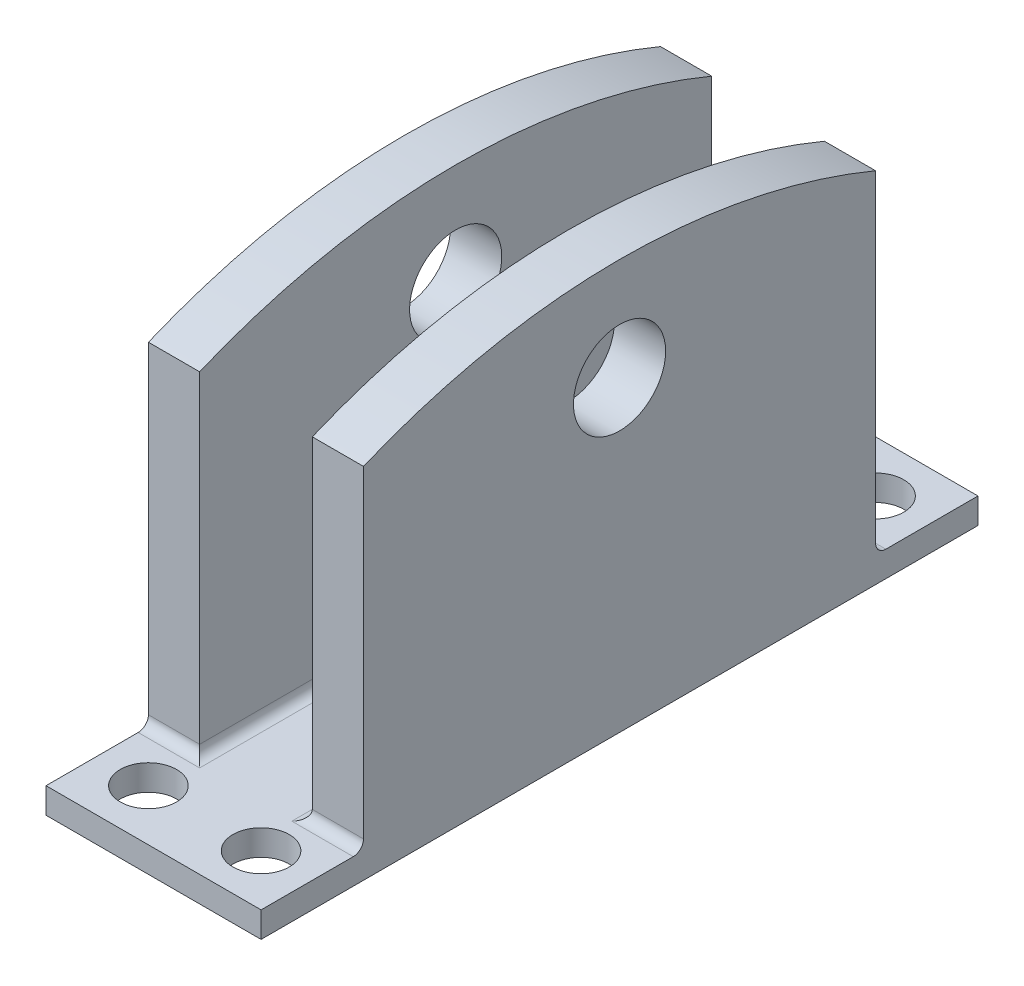
ISO-10303-21;
HEADER;
FILE_DESCRIPTION(('STEP AP214'),'2;1');
FILE_NAME('part.step','',(''),(''),'','','');
FILE_SCHEMA(('AUTOMOTIVE_DESIGN { 1 0 10303 214 1 1 1 1 }'));
ENDSEC;
DATA;
#1=APPLICATION_CONTEXT('core data for automotive mechanical design processes');
#2=APPLICATION_PROTOCOL_DEFINITION('international standard','automotive_design',2000,#1);
#3=PRODUCT_CONTEXT('',#1,'mechanical');
#4=PRODUCT('Part','Part','',(#3));
#5=PRODUCT_RELATED_PRODUCT_CATEGORY('part','',(#4));
#6=PRODUCT_DEFINITION_FORMATION('','',#4);
#7=PRODUCT_DEFINITION_CONTEXT('part definition',#1,'design');
#8=PRODUCT_DEFINITION('design','',#6,#7);
#9=PRODUCT_DEFINITION_SHAPE('','',#8);
#10=(LENGTH_UNIT() NAMED_UNIT(*) SI_UNIT(.MILLI.,.METRE.));
#11=(NAMED_UNIT(*) PLANE_ANGLE_UNIT() SI_UNIT($,.RADIAN.));
#12=(NAMED_UNIT(*) SI_UNIT($,.STERADIAN.) SOLID_ANGLE_UNIT());
#13=UNCERTAINTY_MEASURE_WITH_UNIT(LENGTH_MEASURE(1.E-05),#10,'distance_accuracy_value','');
#14=(GEOMETRIC_REPRESENTATION_CONTEXT(3) GLOBAL_UNCERTAINTY_ASSIGNED_CONTEXT((#13)) GLOBAL_UNIT_ASSIGNED_CONTEXT((#10,
#11,#12)) REPRESENTATION_CONTEXT('',''));
#15=CARTESIAN_POINT('',(0.,0.,0.));
#16=DIRECTION('',(0.,0.,1.));
#17=DIRECTION('',(1.,0.,0.));
#18=AXIS2_PLACEMENT_3D('',#15,#16,#17);
#19=CARTESIAN_POINT('',(5.25352057567163,2.5,50.));
#20=DIRECTION('',(0.,-1.,0.));
#21=DIRECTION('',(1.,0.,0.));
#22=AXIS2_PLACEMENT_3D('',#19,#20,#21);
#23=PLANE('',#22);
#24=CARTESIAN_POINT('',(5.25352057567163,2.5,55.));
#25=DIRECTION('',(0.,1.,0.));
#26=DIRECTION('',(0.,0.,1.));
#27=AXIS2_PLACEMENT_3D('',#24,#25,#26);
#28=CIRCLE('',#27,2.75);
#29=CARTESIAN_POINT('',(5.25352057567163,2.5,57.75));
#30=VERTEX_POINT('',#29);
#31=EDGE_CURVE('E316',#30,#30,#28,.T.);
#32=ORIENTED_EDGE('',*,*,#31,.F.);
#33=EDGE_LOOP('',(#32));
#34=FACE_BOUND('',#33,.T.);
#35=CARTESIAN_POINT('',(16.2535205756716,2.5,55.));
#36=DIRECTION('',(0.,1.,0.));
#37=DIRECTION('',(0.,0.,1.));
#38=AXIS2_PLACEMENT_3D('',#35,#36,#37);
#39=CIRCLE('',#38,2.75);
#40=CARTESIAN_POINT('',(16.2535205756716,2.5,57.75));
#41=VERTEX_POINT('',#40);
#42=EDGE_CURVE('E310',#41,#41,#39,.T.);
#43=ORIENTED_EDGE('',*,*,#42,.F.);
#44=EDGE_LOOP('',(#43));
#45=FACE_BOUND('',#44,.T.);
#46=CARTESIAN_POINT('',(5.25352057567163,2.5,-5.));
#47=DIRECTION('',(0.,1.,0.));
#48=DIRECTION('',(0.,0.,1.));
#49=AXIS2_PLACEMENT_3D('',#46,#47,#48);
#50=CIRCLE('',#49,2.75);
#51=CARTESIAN_POINT('',(5.25352057567163,2.5,-2.25));
#52=VERTEX_POINT('',#51);
#53=EDGE_CURVE('E304',#52,#52,#50,.T.);
#54=ORIENTED_EDGE('',*,*,#53,.F.);
#55=EDGE_LOOP('',(#54));
#56=FACE_BOUND('',#55,.T.);
#57=DIRECTION('',(0.,0.,-1.));
#58=VECTOR('',#57,1.);
#59=CARTESIAN_POINT('',(6.25352057567163,2.5,50.));
#60=LINE('',#59,#58);
#61=CARTESIAN_POINT('',(6.25352057567163,2.5,-1.));
#62=VERTEX_POINT('',#61);
#63=CARTESIAN_POINT('',(6.25352057567163,2.5,51.));
#64=VERTEX_POINT('',#63);
#65=EDGE_CURVE('E264',#62,#64,#60,.F.);
#66=ORIENTED_EDGE('',*,*,#65,.T.);
#67=DIRECTION('',(1.,0.,0.));
#68=VECTOR('',#67,1.);
#69=CARTESIAN_POINT('',(5.25352057567163,2.5,51.));
#70=LINE('',#69,#68);
#71=CARTESIAN_POINT('',(0.253520575671634,2.5,51.));
#72=VERTEX_POINT('',#71);
#73=EDGE_CURVE('E266',#64,#72,#70,.F.);
#74=ORIENTED_EDGE('',*,*,#73,.T.);
#75=DIRECTION('',(0.,0.,-1.));
#76=VECTOR('',#75,1.);
#77=CARTESIAN_POINT('',(0.253520575671635,2.5,50.));
#78=LINE('',#77,#76);
#79=CARTESIAN_POINT('',(0.253520575671627,2.5,60.));
#80=VERTEX_POINT('',#79);
#81=EDGE_CURVE('E170',#80,#72,#78,.T.);
#82=ORIENTED_EDGE('',*,*,#81,.F.);
#83=DIRECTION('',(-1.,0.,0.));
#84=VECTOR('',#83,1.);
#85=CARTESIAN_POINT('',(21.2535205756716,2.5,60.));
#86=LINE('',#85,#84);
#87=CARTESIAN_POINT('',(21.2535205756716,2.5,60.));
#88=VERTEX_POINT('',#87);
#89=EDGE_CURVE('E161',#88,#80,#86,.T.);
#90=ORIENTED_EDGE('',*,*,#89,.F.);
#91=DIRECTION('',(0.,0.,1.));
#92=VECTOR('',#91,1.);
#93=CARTESIAN_POINT('',(21.2535205756716,2.5,50.));
#94=LINE('',#93,#92);
#95=CARTESIAN_POINT('',(21.2535205756716,2.5,51.));
#96=VERTEX_POINT('',#95);
#97=EDGE_CURVE('E150',#96,#88,#94,.T.);
#98=ORIENTED_EDGE('',*,*,#97,.F.);
#99=DIRECTION('',(1.,0.,0.));
#100=VECTOR('',#99,1.);
#101=CARTESIAN_POINT('',(5.25352057567163,2.5,51.));
#102=LINE('',#101,#100);
#103=CARTESIAN_POINT('',(15.2535205756716,2.5,51.));
#104=VERTEX_POINT('',#103);
#105=EDGE_CURVE('E260',#96,#104,#102,.F.);
#106=ORIENTED_EDGE('',*,*,#105,.T.);
#107=DIRECTION('',(0.,0.,-1.));
#108=VECTOR('',#107,1.);
#109=CARTESIAN_POINT('',(15.2535205756716,2.5,0.));
#110=LINE('',#109,#108);
#111=CARTESIAN_POINT('',(15.2535205756716,2.5,-1.));
#112=VERTEX_POINT('',#111);
#113=EDGE_CURVE('E257',#104,#112,#110,.T.);
#114=ORIENTED_EDGE('',*,*,#113,.T.);
#115=DIRECTION('',(-1.,0.,0.));
#116=VECTOR('',#115,1.);
#117=CARTESIAN_POINT('',(21.2535205756716,2.5,-1.));
#118=LINE('',#117,#116);
#119=CARTESIAN_POINT('',(21.2535205756716,2.5,-1.));
#120=VERTEX_POINT('',#119);
#121=EDGE_CURVE('E253',#112,#120,#118,.F.);
#122=ORIENTED_EDGE('',*,*,#121,.T.);
#123=DIRECTION('',(0.,0.,1.));
#124=VECTOR('',#123,1.);
#125=CARTESIAN_POINT('',(21.2535205756716,2.5,0.));
#126=LINE('',#125,#124);
#127=CARTESIAN_POINT('',(21.2535205756716,2.5,-10.));
#128=VERTEX_POINT('',#127);
#129=EDGE_CURVE('E183',#128,#120,#126,.T.);
#130=ORIENTED_EDGE('',*,*,#129,.F.);
#131=DIRECTION('',(1.,0.,0.));
#132=VECTOR('',#131,1.);
#133=CARTESIAN_POINT('',(21.2535205756716,2.5,-10.));
#134=LINE('',#133,#132);
#135=CARTESIAN_POINT('',(0.253520575671635,2.5,-10.));
#136=VERTEX_POINT('',#135);
#137=EDGE_CURVE('E187',#136,#128,#134,.T.);
#138=ORIENTED_EDGE('',*,*,#137,.F.);
#139=DIRECTION('',(0.,0.,-1.));
#140=VECTOR('',#139,1.);
#141=CARTESIAN_POINT('',(0.253520575671635,2.5,0.));
#142=LINE('',#141,#140);
#143=CARTESIAN_POINT('',(0.253520575671635,2.5,-1.));
#144=VERTEX_POINT('',#143);
#145=EDGE_CURVE('E185',#144,#136,#142,.T.);
#146=ORIENTED_EDGE('',*,*,#145,.F.);
#147=DIRECTION('',(-1.,0.,0.));
#148=VECTOR('',#147,1.);
#149=CARTESIAN_POINT('',(5.25352057567163,2.5,-1.));
#150=LINE('',#149,#148);
#151=EDGE_CURVE('E262',#144,#62,#150,.F.);
#152=ORIENTED_EDGE('',*,*,#151,.T.);
#153=EDGE_LOOP('',(#66,#74,#82,#90,#98,#106,#114,#122,#130,#138,#146,#152));
#154=FACE_BOUND('',#153,.T.);
#155=CARTESIAN_POINT('',(16.2535205756716,2.5,-5.));
#156=DIRECTION('',(0.,1.,0.));
#157=DIRECTION('',(0.,0.,1.));
#158=AXIS2_PLACEMENT_3D('',#155,#156,#157);
#159=CIRCLE('',#158,2.75);
#160=CARTESIAN_POINT('',(16.2535205756716,2.5,-2.25));
#161=VERTEX_POINT('',#160);
#162=EDGE_CURVE('E295',#161,#161,#159,.T.);
#163=ORIENTED_EDGE('',*,*,#162,.F.);
#164=EDGE_LOOP('',(#163));
#165=FACE_BOUND('',#164,.T.);
#166=ADVANCED_FACE('F35',(#34,#45,#56,#154,#165),#23,.F.);
#167=CARTESIAN_POINT('',(0.,0.,50.));
#168=DIRECTION('',(0.,0.,1.));
#169=DIRECTION('',(1.,0.,0.));
#170=AXIS2_PLACEMENT_3D('',#167,#168,#169);
#171=PLANE('',#170);
#172=DIRECTION('',(0.,-1.,0.));
#173=VECTOR('',#172,1.);
#174=CARTESIAN_POINT('',(0.253520575671628,50.,50.));
#175=LINE('',#174,#173);
#176=CARTESIAN_POINT('',(0.253520575671622,35.,50.));
#177=VERTEX_POINT('',#176);
#178=CARTESIAN_POINT('',(0.253520575671633,3.5,50.));
#179=VERTEX_POINT('',#178);
#180=EDGE_CURVE('E228',#177,#179,#175,.T.);
#181=ORIENTED_EDGE('',*,*,#180,.T.);
#182=DIRECTION('',(1.,0.,0.));
#183=VECTOR('',#182,1.);
#184=CARTESIAN_POINT('',(0.,3.5,50.));
#185=LINE('',#184,#183);
#186=CARTESIAN_POINT('',(5.25352057567163,3.5,50.));
#187=VERTEX_POINT('',#186);
#188=EDGE_CURVE('E275',#179,#187,#185,.T.);
#189=ORIENTED_EDGE('',*,*,#188,.T.);
#190=DIRECTION('',(0.,1.,0.));
#191=VECTOR('',#190,1.);
#192=CARTESIAN_POINT('',(5.25352057567163,50.,50.));
#193=LINE('',#192,#191);
#194=CARTESIAN_POINT('',(5.25352057567163,35.,50.));
#195=VERTEX_POINT('',#194);
#196=EDGE_CURVE('E237',#187,#195,#193,.T.);
#197=ORIENTED_EDGE('',*,*,#196,.T.);
#198=DIRECTION('',(1.,0.,0.));
#199=VECTOR('',#198,1.);
#200=CARTESIAN_POINT('',(0.253520575671622,35.,50.));
#201=LINE('',#200,#199);
#202=EDGE_CURVE('E215',#177,#195,#201,.T.);
#203=ORIENTED_EDGE('',*,*,#202,.F.);
#204=EDGE_LOOP('',(#181,#189,#197,#203));
#205=FACE_BOUND('',#204,.T.);
#206=ADVANCED_FACE('F324',(#205),#171,.T.);
#207=DIRECTION('',(0.,-1.,0.));
#208=VECTOR('',#207,1.);
#209=CARTESIAN_POINT('',(16.2535205756716,50.,50.));
#210=LINE('',#209,#208);
#211=CARTESIAN_POINT('',(16.2535205756716,35.,50.));
#212=VERTEX_POINT('',#211);
#213=CARTESIAN_POINT('',(16.2535205756716,3.5,50.));
#214=VERTEX_POINT('',#213);
#215=EDGE_CURVE('E234',#212,#214,#210,.T.);
#216=ORIENTED_EDGE('',*,*,#215,.T.);
#217=DIRECTION('',(1.,0.,0.));
#218=VECTOR('',#217,1.);
#219=CARTESIAN_POINT('',(0.,3.5,50.));
#220=LINE('',#219,#218);
#221=CARTESIAN_POINT('',(21.2535205756716,3.5,50.));
#222=VERTEX_POINT('',#221);
#223=EDGE_CURVE('E273',#214,#222,#220,.T.);
#224=ORIENTED_EDGE('',*,*,#223,.T.);
#225=DIRECTION('',(0.,1.,0.));
#226=VECTOR('',#225,1.);
#227=CARTESIAN_POINT('',(21.2535205756716,50.,50.));
#228=LINE('',#227,#226);
#229=CARTESIAN_POINT('',(21.2535205756716,35.,50.));
#230=VERTEX_POINT('',#229);
#231=EDGE_CURVE('E231',#222,#230,#228,.T.);
#232=ORIENTED_EDGE('',*,*,#231,.T.);
#233=EDGE_CURVE('E219',#212,#230,#201,.T.);
#234=ORIENTED_EDGE('',*,*,#233,.F.);
#235=EDGE_LOOP('',(#216,#224,#232,#234));
#236=FACE_BOUND('',#235,.T.);
#237=ADVANCED_FACE('F368',(#236),#171,.T.);
#238=CARTESIAN_POINT('',(0.,0.,0.));
#239=DIRECTION('',(0.,0.,1.));
#240=DIRECTION('',(1.,0.,0.));
#241=AXIS2_PLACEMENT_3D('',#238,#239,#240);
#242=PLANE('',#241);
#243=DIRECTION('',(0.,1.,0.));
#244=VECTOR('',#243,1.);
#245=CARTESIAN_POINT('',(21.2535205756716,50.,0.));
#246=LINE('',#245,#244);
#247=CARTESIAN_POINT('',(21.2535205756716,3.5,0.));
#248=VERTEX_POINT('',#247);
#249=CARTESIAN_POINT('',(21.2535205756716,35.,0.));
#250=VERTEX_POINT('',#249);
#251=EDGE_CURVE('E241',#248,#250,#246,.T.);
#252=ORIENTED_EDGE('',*,*,#251,.F.);
#253=DIRECTION('',(-1.,0.,0.));
#254=VECTOR('',#253,1.);
#255=CARTESIAN_POINT('',(16.2535205756716,3.5,0.));
#256=LINE('',#255,#254);
#257=CARTESIAN_POINT('',(16.2535205756716,3.5,0.));
#258=VERTEX_POINT('',#257);
#259=EDGE_CURVE('E278',#248,#258,#256,.T.);
#260=ORIENTED_EDGE('',*,*,#259,.T.);
#261=DIRECTION('',(0.,-1.,0.));
#262=VECTOR('',#261,1.);
#263=CARTESIAN_POINT('',(16.2535205756716,50.,0.));
#264=LINE('',#263,#262);
#265=CARTESIAN_POINT('',(16.2535205756716,35.,0.));
#266=VERTEX_POINT('',#265);
#267=EDGE_CURVE('E243',#266,#258,#264,.T.);
#268=ORIENTED_EDGE('',*,*,#267,.F.);
#269=DIRECTION('',(1.,0.,0.));
#270=VECTOR('',#269,1.);
#271=CARTESIAN_POINT('',(0.253520575671622,35.,0.));
#272=LINE('',#271,#270);
#273=EDGE_CURVE('E250',#266,#250,#272,.T.);
#274=ORIENTED_EDGE('',*,*,#273,.T.);
#275=EDGE_LOOP('',(#252,#260,#268,#274));
#276=FACE_BOUND('',#275,.T.);
#277=ADVANCED_FACE('F373',(#276),#242,.F.);
#278=CARTESIAN_POINT('',(0.253520575671628,50.,50.));
#279=DIRECTION('',(1.,0.,0.));
#280=DIRECTION('',(0.,1.,0.));
#281=AXIS2_PLACEMENT_3D('',#278,#279,#280);
#282=PLANE('',#281);
#283=CARTESIAN_POINT('',(0.253520575671632,30.,25.));
#284=DIRECTION('',(1.,0.,0.));
#285=DIRECTION('',(0.,1.,0.));
#286=AXIS2_PLACEMENT_3D('',#283,#284,#285);
#287=CIRCLE('',#286,4.5);
#288=CARTESIAN_POINT('',(0.253520575671631,34.5,25.));
#289=VERTEX_POINT('',#288);
#290=EDGE_CURVE('E205',#289,#289,#287,.T.);
#291=ORIENTED_EDGE('',*,*,#290,.T.);
#292=EDGE_LOOP('',(#291));
#293=FACE_BOUND('',#292,.T.);
#294=ORIENTED_EDGE('',*,*,#180,.F.);
#295=CARTESIAN_POINT('',(0.253520575671635,-25.0000000000001,25.));
#296=DIRECTION('',(-1.,0.,0.));
#297=DIRECTION('',(0.,-1.,0.));
#298=AXIS2_PLACEMENT_3D('',#295,#296,#297);
#299=CIRCLE('',#298,65.);
#300=CARTESIAN_POINT('',(0.253520575671622,35.,0.));
#301=VERTEX_POINT('',#300);
#302=EDGE_CURVE('E209',#177,#301,#299,.T.);
#303=ORIENTED_EDGE('',*,*,#302,.T.);
#304=DIRECTION('',(0.,-1.,0.));
#305=VECTOR('',#304,1.);
#306=CARTESIAN_POINT('',(0.253520575671628,50.,0.));
#307=LINE('',#306,#305);
#308=CARTESIAN_POINT('',(0.253520575671633,3.5,0.));
#309=VERTEX_POINT('',#308);
#310=EDGE_CURVE('E227',#301,#309,#307,.T.);
#311=ORIENTED_EDGE('',*,*,#310,.T.);
#312=CARTESIAN_POINT('',(0.253520575671633,3.5,-1.));
#313=DIRECTION('',(1.,0.,0.));
#314=DIRECTION('',(0.,1.,0.));
#315=AXIS2_PLACEMENT_3D('',#312,#313,#314);
#316=CIRCLE('',#315,1.);
#317=EDGE_CURVE('E44',#309,#144,#316,.T.);
#318=ORIENTED_EDGE('',*,*,#317,.T.);
#319=ORIENTED_EDGE('',*,*,#145,.T.);
#320=DIRECTION('',(0.,-1.,0.));
#321=VECTOR('',#320,1.);
#322=CARTESIAN_POINT('',(0.253520575671635,2.5,-10.));
#323=LINE('',#322,#321);
#324=CARTESIAN_POINT('',(0.253520575671635,0.,-10.));
#325=VERTEX_POINT('',#324);
#326=EDGE_CURVE('E190',#136,#325,#323,.T.);
#327=ORIENTED_EDGE('',*,*,#326,.T.);
#328=DIRECTION('',(0.,0.,-1.));
#329=VECTOR('',#328,1.);
#330=CARTESIAN_POINT('',(0.253520575671634,0.,50.));
#331=LINE('',#330,#329);
#332=CARTESIAN_POINT('',(0.253520575671627,0.,60.));
#333=VERTEX_POINT('',#332);
#334=EDGE_CURVE('E248',#333,#325,#331,.T.);
#335=ORIENTED_EDGE('',*,*,#334,.F.);
#336=DIRECTION('',(0.,-1.,0.));
#337=VECTOR('',#336,1.);
#338=CARTESIAN_POINT('',(0.253520575671627,2.5,60.));
#339=LINE('',#338,#337);
#340=EDGE_CURVE('E169',#80,#333,#339,.T.);
#341=ORIENTED_EDGE('',*,*,#340,.F.);
#342=ORIENTED_EDGE('',*,*,#81,.T.);
#343=CARTESIAN_POINT('',(0.253520575671633,3.5,51.));
#344=DIRECTION('',(1.,0.,0.));
#345=DIRECTION('',(0.,1.,0.));
#346=AXIS2_PLACEMENT_3D('',#343,#344,#345);
#347=CIRCLE('',#346,1.);
#348=EDGE_CURVE('E281',#72,#179,#347,.T.);
#349=ORIENTED_EDGE('',*,*,#348,.T.);
#350=EDGE_LOOP('',(#294,#303,#311,#318,#319,#327,#335,#341,#342,#349));
#351=FACE_BOUND('',#350,.T.);
#352=ADVANCED_FACE('F387',(#293,#351),#282,.F.);
#353=CARTESIAN_POINT('',(0.253520575671634,0.,50.));
#354=DIRECTION('',(0.,1.,0.));
#355=DIRECTION('',(-1.,0.,0.));
#356=AXIS2_PLACEMENT_3D('',#353,#354,#355);
#357=PLANE('',#356);
#358=CARTESIAN_POINT('',(5.25352057567163,0.,55.));
#359=DIRECTION('',(0.,1.,0.));
#360=DIRECTION('',(0.,0.,1.));
#361=AXIS2_PLACEMENT_3D('',#358,#359,#360);
#362=CIRCLE('',#361,2.75);
#363=CARTESIAN_POINT('',(5.25352057567163,0.,57.75));
#364=VERTEX_POINT('',#363);
#365=EDGE_CURVE('E313',#364,#364,#362,.T.);
#366=ORIENTED_EDGE('',*,*,#365,.T.);
#367=EDGE_LOOP('',(#366));
#368=FACE_BOUND('',#367,.T.);
#369=CARTESIAN_POINT('',(16.2535205756716,0.,55.));
#370=DIRECTION('',(0.,1.,0.));
#371=DIRECTION('',(0.,0.,1.));
#372=AXIS2_PLACEMENT_3D('',#369,#370,#371);
#373=CIRCLE('',#372,2.75);
#374=CARTESIAN_POINT('',(16.2535205756716,0.,57.75));
#375=VERTEX_POINT('',#374);
#376=EDGE_CURVE('E307',#375,#375,#373,.T.);
#377=ORIENTED_EDGE('',*,*,#376,.T.);
#378=EDGE_LOOP('',(#377));
#379=FACE_BOUND('',#378,.T.);
#380=CARTESIAN_POINT('',(5.25352057567163,0.,-5.));
#381=DIRECTION('',(0.,1.,0.));
#382=DIRECTION('',(0.,0.,1.));
#383=AXIS2_PLACEMENT_3D('',#380,#381,#382);
#384=CIRCLE('',#383,2.75);
#385=CARTESIAN_POINT('',(5.25352057567163,0.,-2.25));
#386=VERTEX_POINT('',#385);
#387=EDGE_CURVE('E299',#386,#386,#384,.T.);
#388=ORIENTED_EDGE('',*,*,#387,.T.);
#389=EDGE_LOOP('',(#388));
#390=FACE_BOUND('',#389,.T.);
#391=CARTESIAN_POINT('',(16.2535205756716,0.,-5.));
#392=DIRECTION('',(0.,1.,0.));
#393=DIRECTION('',(0.,0.,1.));
#394=AXIS2_PLACEMENT_3D('',#391,#392,#393);
#395=CIRCLE('',#394,2.75);
#396=CARTESIAN_POINT('',(16.2535205756716,0.,-2.25));
#397=VERTEX_POINT('',#396);
#398=EDGE_CURVE('E288',#397,#397,#395,.T.);
#399=ORIENTED_EDGE('',*,*,#398,.T.);
#400=EDGE_LOOP('',(#399));
#401=FACE_BOUND('',#400,.T.);
#402=ORIENTED_EDGE('',*,*,#334,.T.);
#403=DIRECTION('',(1.,0.,0.));
#404=VECTOR('',#403,1.);
#405=CARTESIAN_POINT('',(21.2535205756716,0.,-10.));
#406=LINE('',#405,#404);
#407=CARTESIAN_POINT('',(21.2535205756716,0.,-10.));
#408=VERTEX_POINT('',#407);
#409=EDGE_CURVE('E181',#325,#408,#406,.T.);
#410=ORIENTED_EDGE('',*,*,#409,.T.);
#411=DIRECTION('',(0.,0.,-1.));
#412=VECTOR('',#411,1.);
#413=CARTESIAN_POINT('',(21.2535205756716,0.,50.));
#414=LINE('',#413,#412);
#415=CARTESIAN_POINT('',(21.2535205756716,0.,60.));
#416=VERTEX_POINT('',#415);
#417=EDGE_CURVE('E239',#416,#408,#414,.T.);
#418=ORIENTED_EDGE('',*,*,#417,.F.);
#419=DIRECTION('',(-1.,0.,0.));
#420=VECTOR('',#419,1.);
#421=CARTESIAN_POINT('',(21.2535205756716,0.,60.));
#422=LINE('',#421,#420);
#423=EDGE_CURVE('E162',#416,#333,#422,.T.);
#424=ORIENTED_EDGE('',*,*,#423,.T.);
#425=EDGE_LOOP('',(#402,#410,#418,#424));
#426=FACE_BOUND('',#425,.T.);
#427=ADVANCED_FACE('F383',(#368,#379,#390,#401,#426),#357,.F.);
#428=CARTESIAN_POINT('',(21.2535205756716,50.,50.));
#429=DIRECTION('',(-1.,0.,0.));
#430=DIRECTION('',(0.,0.,1.));
#431=AXIS2_PLACEMENT_3D('',#428,#429,#430);
#432=PLANE('',#431);
#433=CARTESIAN_POINT('',(21.2535205756716,30.,25.));
#434=DIRECTION('',(1.,0.,0.));
#435=DIRECTION('',(0.,0.,-1.));
#436=AXIS2_PLACEMENT_3D('',#433,#434,#435);
#437=CIRCLE('',#436,4.5);
#438=CARTESIAN_POINT('',(21.2535205756716,30.,20.5));
#439=VERTEX_POINT('',#438);
#440=EDGE_CURVE('E196',#439,#439,#437,.T.);
#441=ORIENTED_EDGE('',*,*,#440,.F.);
#442=EDGE_LOOP('',(#441));
#443=FACE_BOUND('',#442,.T.);
#444=ORIENTED_EDGE('',*,*,#417,.T.);
#445=DIRECTION('',(0.,-1.,0.));
#446=VECTOR('',#445,1.);
#447=CARTESIAN_POINT('',(21.2535205756716,2.5,-10.));
#448=LINE('',#447,#446);
#449=EDGE_CURVE('E193',#128,#408,#448,.T.);
#450=ORIENTED_EDGE('',*,*,#449,.F.);
#451=ORIENTED_EDGE('',*,*,#129,.T.);
#452=CARTESIAN_POINT('',(21.2535205756716,3.5,-1.));
#453=DIRECTION('',(-1.,0.,0.));
#454=DIRECTION('',(0.,0.,1.));
#455=AXIS2_PLACEMENT_3D('',#452,#453,#454);
#456=CIRCLE('',#455,1.);
#457=EDGE_CURVE('E11',#120,#248,#456,.T.);
#458=ORIENTED_EDGE('',*,*,#457,.T.);
#459=ORIENTED_EDGE('',*,*,#251,.T.);
#460=CARTESIAN_POINT('',(21.2535205756716,-25.,25.));
#461=DIRECTION('',(-1.,0.,0.));
#462=DIRECTION('',(0.,-1.,0.));
#463=AXIS2_PLACEMENT_3D('',#460,#461,#462);
#464=CIRCLE('',#463,65.);
#465=EDGE_CURVE('E208',#230,#250,#464,.T.);
#466=ORIENTED_EDGE('',*,*,#465,.F.);
#467=ORIENTED_EDGE('',*,*,#231,.F.);
#468=CARTESIAN_POINT('',(21.2535205756716,3.5,51.));
#469=DIRECTION('',(-1.,0.,0.));
#470=DIRECTION('',(0.,0.,1.));
#471=AXIS2_PLACEMENT_3D('',#468,#469,#470);
#472=CIRCLE('',#471,1.);
#473=EDGE_CURVE('E157',#222,#96,#472,.T.);
#474=ORIENTED_EDGE('',*,*,#473,.T.);
#475=ORIENTED_EDGE('',*,*,#97,.T.);
#476=DIRECTION('',(0.,-1.,0.));
#477=VECTOR('',#476,1.);
#478=CARTESIAN_POINT('',(21.2535205756716,2.5,60.));
#479=LINE('',#478,#477);
#480=EDGE_CURVE('E153',#88,#416,#479,.T.);
#481=ORIENTED_EDGE('',*,*,#480,.T.);
#482=EDGE_LOOP('',(#444,#450,#451,#458,#459,#466,#467,#474,#475,#481));
#483=FACE_BOUND('',#482,.T.);
#484=ADVANCED_FACE('F152',(#443,#483),#432,.F.);
#485=CARTESIAN_POINT('',(16.2535205756716,50.,50.));
#486=DIRECTION('',(1.,0.,0.));
#487=DIRECTION('',(0.,1.,0.));
#488=AXIS2_PLACEMENT_3D('',#485,#486,#487);
#489=PLANE('',#488);
#490=CARTESIAN_POINT('',(16.2535205756716,30.,25.));
#491=DIRECTION('',(1.,0.,0.));
#492=DIRECTION('',(0.,1.,0.));
#493=AXIS2_PLACEMENT_3D('',#490,#491,#492);
#494=CIRCLE('',#493,4.5);
#495=CARTESIAN_POINT('',(16.2535205756716,34.5,25.));
#496=VERTEX_POINT('',#495);
#497=EDGE_CURVE('E202',#496,#496,#494,.T.);
#498=ORIENTED_EDGE('',*,*,#497,.T.);
#499=EDGE_LOOP('',(#498));
#500=FACE_BOUND('',#499,.T.);
#501=ORIENTED_EDGE('',*,*,#267,.T.);
#502=DIRECTION('',(0.,0.,-1.));
#503=VECTOR('',#502,1.);
#504=CARTESIAN_POINT('',(16.2535205756716,3.5,50.));
#505=LINE('',#504,#503);
#506=EDGE_CURVE('E268',#258,#214,#505,.F.);
#507=ORIENTED_EDGE('',*,*,#506,.T.);
#508=ORIENTED_EDGE('',*,*,#215,.F.);
#509=CARTESIAN_POINT('',(16.2535205756716,-25.,25.));
#510=DIRECTION('',(1.,0.,0.));
#511=DIRECTION('',(0.,1.,0.));
#512=AXIS2_PLACEMENT_3D('',#509,#510,#511);
#513=CIRCLE('',#512,65.);
#514=EDGE_CURVE('E224',#212,#266,#513,.F.);
#515=ORIENTED_EDGE('',*,*,#514,.T.);
#516=EDGE_LOOP('',(#501,#507,#508,#515));
#517=FACE_BOUND('',#516,.T.);
#518=ADVANCED_FACE('F375',(#500,#517),#489,.F.);
#519=CARTESIAN_POINT('',(5.25352057567163,50.,50.));
#520=DIRECTION('',(-1.,0.,0.));
#521=DIRECTION('',(0.,-1.,0.));
#522=AXIS2_PLACEMENT_3D('',#519,#520,#521);
#523=PLANE('',#522);
#524=CARTESIAN_POINT('',(5.25352057567163,30.,25.));
#525=DIRECTION('',(-1.,0.,0.));
#526=DIRECTION('',(0.,-1.,0.));
#527=AXIS2_PLACEMENT_3D('',#524,#525,#526);
#528=CIRCLE('',#527,4.5);
#529=CARTESIAN_POINT('',(5.25352057567163,25.5,25.));
#530=VERTEX_POINT('',#529);
#531=EDGE_CURVE('E201',#530,#530,#528,.T.);
#532=ORIENTED_EDGE('',*,*,#531,.T.);
#533=EDGE_LOOP('',(#532));
#534=FACE_BOUND('',#533,.T.);
#535=ORIENTED_EDGE('',*,*,#196,.F.);
#536=DIRECTION('',(0.,0.,-1.));
#537=VECTOR('',#536,1.);
#538=CARTESIAN_POINT('',(5.25352057567163,3.5,0.));
#539=LINE('',#538,#537);
#540=CARTESIAN_POINT('',(5.25352057567163,3.5,0.));
#541=VERTEX_POINT('',#540);
#542=EDGE_CURVE('E270',#187,#541,#539,.T.);
#543=ORIENTED_EDGE('',*,*,#542,.T.);
#544=DIRECTION('',(0.,1.,0.));
#545=VECTOR('',#544,1.);
#546=CARTESIAN_POINT('',(5.25352057567163,50.,0.));
#547=LINE('',#546,#545);
#548=CARTESIAN_POINT('',(5.25352057567163,35.,0.));
#549=VERTEX_POINT('',#548);
#550=EDGE_CURVE('E232',#541,#549,#547,.T.);
#551=ORIENTED_EDGE('',*,*,#550,.T.);
#552=CARTESIAN_POINT('',(5.25352057567164,-25.0000000000001,25.));
#553=DIRECTION('',(-1.,0.,0.));
#554=DIRECTION('',(0.,-1.,0.));
#555=AXIS2_PLACEMENT_3D('',#552,#553,#554);
#556=CIRCLE('',#555,65.);
#557=EDGE_CURVE('E218',#549,#195,#556,.F.);
#558=ORIENTED_EDGE('',*,*,#557,.T.);
#559=EDGE_LOOP('',(#535,#543,#551,#558));
#560=FACE_BOUND('',#559,.T.);
#561=ADVANCED_FACE('F372',(#534,#560),#523,.F.);
#562=ORIENTED_EDGE('',*,*,#550,.F.);
#563=DIRECTION('',(-1.,0.,0.));
#564=VECTOR('',#563,1.);
#565=CARTESIAN_POINT('',(0.253520575671633,3.5,0.));
#566=LINE('',#565,#564);
#567=EDGE_CURVE('E58',#541,#309,#566,.T.);
#568=ORIENTED_EDGE('',*,*,#567,.T.);
#569=ORIENTED_EDGE('',*,*,#310,.F.);
#570=DIRECTION('',(1.,0.,0.));
#571=VECTOR('',#570,1.);
#572=CARTESIAN_POINT('',(0.253520575671622,35.,0.));
#573=LINE('',#572,#571);
#574=EDGE_CURVE('E212',#301,#549,#573,.T.);
#575=ORIENTED_EDGE('',*,*,#574,.T.);
#576=EDGE_LOOP('',(#562,#568,#569,#575));
#577=FACE_BOUND('',#576,.T.);
#578=ADVANCED_FACE('F364',(#577),#242,.F.);
#579=CARTESIAN_POINT('',(0.253520575671635,-25.0000000000001,25.));
#580=DIRECTION('',(1.,0.,0.));
#581=DIRECTION('',(0.,1.,0.));
#582=AXIS2_PLACEMENT_3D('',#579,#580,#581);
#583=CYLINDRICAL_SURFACE('',#582,65.);
#584=ORIENTED_EDGE('',*,*,#233,.T.);
#585=ORIENTED_EDGE('',*,*,#465,.T.);
#586=ORIENTED_EDGE('',*,*,#273,.F.);
#587=ORIENTED_EDGE('',*,*,#514,.F.);
#588=EDGE_LOOP('',(#584,#585,#586,#587));
#589=FACE_BOUND('',#588,.T.);
#590=ADVANCED_FACE('F361',(#589),#583,.T.);
#591=ORIENTED_EDGE('',*,*,#574,.F.);
#592=ORIENTED_EDGE('',*,*,#302,.F.);
#593=ORIENTED_EDGE('',*,*,#202,.T.);
#594=ORIENTED_EDGE('',*,*,#557,.F.);
#595=EDGE_LOOP('',(#591,#592,#593,#594));
#596=FACE_BOUND('',#595,.T.);
#597=ADVANCED_FACE('F359',(#596),#583,.T.);
#598=CARTESIAN_POINT('',(21.2535205756716,30.,25.));
#599=DIRECTION('',(1.,0.,0.));
#600=DIRECTION('',(0.,0.,-1.));
#601=AXIS2_PLACEMENT_3D('',#598,#599,#600);
#602=CYLINDRICAL_SURFACE('',#601,4.5);
#603=ORIENTED_EDGE('',*,*,#531,.F.);
#604=EDGE_LOOP('',(#603));
#605=FACE_BOUND('',#604,.T.);
#606=ORIENTED_EDGE('',*,*,#290,.F.);
#607=EDGE_LOOP('',(#606));
#608=FACE_BOUND('',#607,.T.);
#609=ADVANCED_FACE('F356',(#605,#608),#602,.F.);
#610=ORIENTED_EDGE('',*,*,#440,.T.);
#611=EDGE_LOOP('',(#610));
#612=FACE_BOUND('',#611,.T.);
#613=ORIENTED_EDGE('',*,*,#497,.F.);
#614=EDGE_LOOP('',(#613));
#615=FACE_BOUND('',#614,.T.);
#616=ADVANCED_FACE('F354',(#612,#615),#602,.F.);
#617=CARTESIAN_POINT('',(21.2535205756716,2.5,-10.));
#618=DIRECTION('',(0.,0.,-1.));
#619=DIRECTION('',(-1.,0.,0.));
#620=AXIS2_PLACEMENT_3D('',#617,#618,#619);
#621=PLANE('',#620);
#622=ORIENTED_EDGE('',*,*,#409,.F.);
#623=ORIENTED_EDGE('',*,*,#326,.F.);
#624=ORIENTED_EDGE('',*,*,#137,.T.);
#625=ORIENTED_EDGE('',*,*,#449,.T.);
#626=EDGE_LOOP('',(#622,#623,#624,#625));
#627=FACE_BOUND('',#626,.T.);
#628=ADVANCED_FACE('F351',(#627),#621,.T.);
#629=CARTESIAN_POINT('',(21.2535205756716,2.5,60.));
#630=DIRECTION('',(0.,0.,1.));
#631=DIRECTION('',(1.,0.,0.));
#632=AXIS2_PLACEMENT_3D('',#629,#630,#631);
#633=PLANE('',#632);
#634=ORIENTED_EDGE('',*,*,#423,.F.);
#635=ORIENTED_EDGE('',*,*,#480,.F.);
#636=ORIENTED_EDGE('',*,*,#89,.T.);
#637=ORIENTED_EDGE('',*,*,#340,.T.);
#638=EDGE_LOOP('',(#634,#635,#636,#637));
#639=FACE_BOUND('',#638,.T.);
#640=ADVANCED_FACE('F166',(#639),#633,.T.);
#641=CARTESIAN_POINT('',(0.,3.5,51.));
#642=DIRECTION('',(1.,0.,0.));
#643=DIRECTION('',(0.,1.,0.));
#644=AXIS2_PLACEMENT_3D('',#641,#642,#643);
#645=CYLINDRICAL_SURFACE('',#644,1.);
#646=ORIENTED_EDGE('',*,*,#473,.F.);
#647=ORIENTED_EDGE('',*,*,#223,.F.);
#648=CARTESIAN_POINT('',(15.2535205756716,3.5,51.));
#649=DIRECTION('',(0.707106781186547,0.,0.707106781186547));
#650=DIRECTION('',(0.707106781186547,0.,-0.707106781186547));
#651=AXIS2_PLACEMENT_3D('',#648,#649,#650);
#652=ELLIPSE('',#651,1.41421356237309,1.);
#653=EDGE_CURVE('E180',#104,#214,#652,.T.);
#654=ORIENTED_EDGE('',*,*,#653,.F.);
#655=ORIENTED_EDGE('',*,*,#105,.F.);
#656=EDGE_LOOP('',(#646,#647,#654,#655));
#657=FACE_BOUND('',#656,.T.);
#658=ADVANCED_FACE('F350',(#657),#645,.F.);
#659=CARTESIAN_POINT('',(0.,3.5,-1.));
#660=DIRECTION('',(1.,0.,0.));
#661=DIRECTION('',(0.,1.,0.));
#662=AXIS2_PLACEMENT_3D('',#659,#660,#661);
#663=CYLINDRICAL_SURFACE('',#662,1.);
#664=ORIENTED_EDGE('',*,*,#457,.F.);
#665=ORIENTED_EDGE('',*,*,#121,.F.);
#666=CARTESIAN_POINT('',(15.2535205756716,3.5,-1.));
#667=DIRECTION('',(0.707106781186547,0.,-0.707106781186547));
#668=DIRECTION('',(0.707106781186547,0.,0.707106781186547));
#669=AXIS2_PLACEMENT_3D('',#666,#667,#668);
#670=ELLIPSE('',#669,1.41421356237309,1.);
#671=EDGE_CURVE('E284',#258,#112,#670,.T.);
#672=ORIENTED_EDGE('',*,*,#671,.F.);
#673=ORIENTED_EDGE('',*,*,#259,.F.);
#674=EDGE_LOOP('',(#664,#665,#672,#673));
#675=FACE_BOUND('',#674,.T.);
#676=ADVANCED_FACE('F395',(#675),#663,.F.);
#677=CARTESIAN_POINT('',(15.2535205756716,3.5,50.));
#678=DIRECTION('',(0.,0.,1.));
#679=DIRECTION('',(1.,0.,0.));
#680=AXIS2_PLACEMENT_3D('',#677,#678,#679);
#681=CYLINDRICAL_SURFACE('',#680,1.);
#682=ORIENTED_EDGE('',*,*,#653,.T.);
#683=ORIENTED_EDGE('',*,*,#506,.F.);
#684=ORIENTED_EDGE('',*,*,#671,.T.);
#685=ORIENTED_EDGE('',*,*,#113,.F.);
#686=EDGE_LOOP('',(#682,#683,#684,#685));
#687=FACE_BOUND('',#686,.T.);
#688=ADVANCED_FACE('F392',(#687),#681,.F.);
#689=CARTESIAN_POINT('',(0.,3.5,51.));
#690=DIRECTION('',(1.,0.,0.));
#691=DIRECTION('',(0.,1.,0.));
#692=AXIS2_PLACEMENT_3D('',#689,#690,#691);
#693=CYLINDRICAL_SURFACE('',#692,1.);
#694=ORIENTED_EDGE('',*,*,#348,.F.);
#695=ORIENTED_EDGE('',*,*,#73,.F.);
#696=CARTESIAN_POINT('',(6.25352057567163,3.5,51.));
#697=DIRECTION('',(0.707106781186547,0.,-0.707106781186547));
#698=DIRECTION('',(0.707106781186547,0.,0.707106781186547));
#699=AXIS2_PLACEMENT_3D('',#696,#697,#698);
#700=ELLIPSE('',#699,1.41421356237309,1.);
#701=EDGE_CURVE('E39',#187,#64,#700,.F.);
#702=ORIENTED_EDGE('',*,*,#701,.F.);
#703=ORIENTED_EDGE('',*,*,#188,.F.);
#704=EDGE_LOOP('',(#694,#695,#702,#703));
#705=FACE_BOUND('',#704,.T.);
#706=ADVANCED_FACE('F37',(#705),#693,.F.);
#707=CARTESIAN_POINT('',(0.,3.5,-1.));
#708=DIRECTION('',(1.,0.,0.));
#709=DIRECTION('',(0.,1.,0.));
#710=AXIS2_PLACEMENT_3D('',#707,#708,#709);
#711=CYLINDRICAL_SURFACE('',#710,1.);
#712=ORIENTED_EDGE('',*,*,#317,.F.);
#713=ORIENTED_EDGE('',*,*,#567,.F.);
#714=CARTESIAN_POINT('',(6.25352057567163,3.5,-1.));
#715=DIRECTION('',(0.707106781186547,0.,0.707106781186547));
#716=DIRECTION('',(0.707106781186547,0.,-0.707106781186547));
#717=AXIS2_PLACEMENT_3D('',#714,#715,#716);
#718=ELLIPSE('',#717,1.41421356237309,1.);
#719=EDGE_CURVE('E287',#62,#541,#718,.F.);
#720=ORIENTED_EDGE('',*,*,#719,.F.);
#721=ORIENTED_EDGE('',*,*,#151,.F.);
#722=EDGE_LOOP('',(#712,#713,#720,#721));
#723=FACE_BOUND('',#722,.T.);
#724=ADVANCED_FACE('F404',(#723),#711,.F.);
#725=CARTESIAN_POINT('',(6.25352057567163,3.5,50.));
#726=DIRECTION('',(0.,0.,1.));
#727=DIRECTION('',(1.,0.,0.));
#728=AXIS2_PLACEMENT_3D('',#725,#726,#727);
#729=CYLINDRICAL_SURFACE('',#728,1.);
#730=ORIENTED_EDGE('',*,*,#701,.T.);
#731=ORIENTED_EDGE('',*,*,#65,.F.);
#732=ORIENTED_EDGE('',*,*,#719,.T.);
#733=ORIENTED_EDGE('',*,*,#542,.F.);
#734=EDGE_LOOP('',(#730,#731,#732,#733));
#735=FACE_BOUND('',#734,.T.);
#736=ADVANCED_FACE('F342',(#735),#729,.F.);
#737=CARTESIAN_POINT('',(16.2535205756716,2.5,-5.));
#738=DIRECTION('',(0.,1.,0.));
#739=DIRECTION('',(0.,0.,1.));
#740=AXIS2_PLACEMENT_3D('',#737,#738,#739);
#741=CYLINDRICAL_SURFACE('',#740,2.75);
#742=ORIENTED_EDGE('',*,*,#398,.F.);
#743=EDGE_LOOP('',(#742));
#744=FACE_BOUND('',#743,.T.);
#745=ORIENTED_EDGE('',*,*,#162,.T.);
#746=EDGE_LOOP('',(#745));
#747=FACE_BOUND('',#746,.T.);
#748=ADVANCED_FACE('F333',(#744,#747),#741,.F.);
#749=CARTESIAN_POINT('',(5.25352057567163,2.5,-5.));
#750=DIRECTION('',(0.,1.,0.));
#751=DIRECTION('',(0.,0.,1.));
#752=AXIS2_PLACEMENT_3D('',#749,#750,#751);
#753=CYLINDRICAL_SURFACE('',#752,2.75);
#754=ORIENTED_EDGE('',*,*,#387,.F.);
#755=EDGE_LOOP('',(#754));
#756=FACE_BOUND('',#755,.T.);
#757=ORIENTED_EDGE('',*,*,#53,.T.);
#758=EDGE_LOOP('',(#757));
#759=FACE_BOUND('',#758,.T.);
#760=ADVANCED_FACE('F330',(#756,#759),#753,.F.);
#761=CARTESIAN_POINT('',(16.2535205756716,2.5,55.));
#762=DIRECTION('',(0.,1.,0.));
#763=DIRECTION('',(0.,0.,1.));
#764=AXIS2_PLACEMENT_3D('',#761,#762,#763);
#765=CYLINDRICAL_SURFACE('',#764,2.75);
#766=ORIENTED_EDGE('',*,*,#376,.F.);
#767=EDGE_LOOP('',(#766));
#768=FACE_BOUND('',#767,.T.);
#769=ORIENTED_EDGE('',*,*,#42,.T.);
#770=EDGE_LOOP('',(#769));
#771=FACE_BOUND('',#770,.T.);
#772=ADVANCED_FACE('F332',(#768,#771),#765,.F.);
#773=CARTESIAN_POINT('',(5.25352057567163,2.5,55.));
#774=DIRECTION('',(0.,1.,0.));
#775=DIRECTION('',(0.,0.,1.));
#776=AXIS2_PLACEMENT_3D('',#773,#774,#775);
#777=CYLINDRICAL_SURFACE('',#776,2.75);
#778=ORIENTED_EDGE('',*,*,#365,.F.);
#779=EDGE_LOOP('',(#778));
#780=FACE_BOUND('',#779,.T.);
#781=ORIENTED_EDGE('',*,*,#31,.T.);
#782=EDGE_LOOP('',(#781));
#783=FACE_BOUND('',#782,.T.);
#784=ADVANCED_FACE('F320',(#780,#783),#777,.F.);
#785=CLOSED_SHELL('',(#166,#206,#237,#277,#352,#427,#484,#518,#561,#578,#590,#597,#609,#616,
#628,#640,#658,#676,#688,#706,#724,#736,#748,#760,#772,#784));
#786=MANIFOLD_SOLID_BREP('B2',#785);
#787=ADVANCED_BREP_SHAPE_REPRESENTATION('',(#18,#786),#14);
#788=SHAPE_DEFINITION_REPRESENTATION(#9,#787);
ENDSEC;
END-ISO-10303-21;
